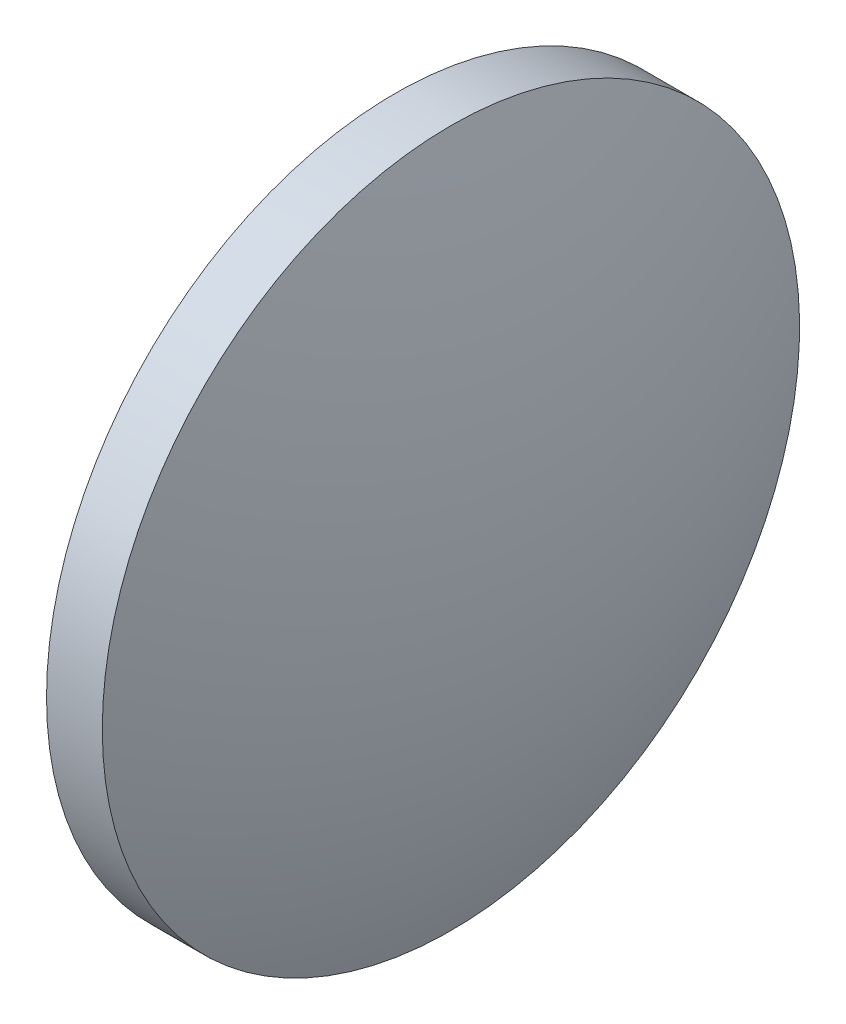
ISO-10303-21;
HEADER;
FILE_DESCRIPTION(('STEP AP214'),'2;1');
FILE_NAME('part.step','',(''),(''),'','','');
FILE_SCHEMA(('AUTOMOTIVE_DESIGN { 1 0 10303 214 1 1 1 1 }'));
ENDSEC;
DATA;
#1=APPLICATION_CONTEXT('core data for automotive mechanical design processes');
#2=APPLICATION_PROTOCOL_DEFINITION('international standard','automotive_design',2000,#1);
#3=PRODUCT_CONTEXT('',#1,'mechanical');
#4=PRODUCT('Part','Part','',(#3));
#5=PRODUCT_RELATED_PRODUCT_CATEGORY('part','',(#4));
#6=PRODUCT_DEFINITION_FORMATION('','',#4);
#7=PRODUCT_DEFINITION_CONTEXT('part definition',#1,'design');
#8=PRODUCT_DEFINITION('design','',#6,#7);
#9=PRODUCT_DEFINITION_SHAPE('','',#8);
#10=(LENGTH_UNIT() NAMED_UNIT(*) SI_UNIT(.MILLI.,.METRE.));
#11=(NAMED_UNIT(*) PLANE_ANGLE_UNIT() SI_UNIT($,.RADIAN.));
#12=(NAMED_UNIT(*) SI_UNIT($,.STERADIAN.) SOLID_ANGLE_UNIT());
#13=UNCERTAINTY_MEASURE_WITH_UNIT(LENGTH_MEASURE(1.E-05),#10,'distance_accuracy_value','');
#14=(GEOMETRIC_REPRESENTATION_CONTEXT(3) GLOBAL_UNCERTAINTY_ASSIGNED_CONTEXT((#13)) GLOBAL_UNIT_ASSIGNED_CONTEXT((#10,
#11,#12)) REPRESENTATION_CONTEXT('',''));
#15=CARTESIAN_POINT('',(0.,0.,0.));
#16=DIRECTION('',(0.,0.,1.));
#17=DIRECTION('',(1.,0.,0.));
#18=AXIS2_PLACEMENT_3D('',#15,#16,#17);
#19=CARTESIAN_POINT('',(346.780674841127,381.227799172368,0.));
#20=DIRECTION('',(-1.,0.,0.));
#21=DIRECTION('',(0.,1.,0.));
#22=AXIS2_PLACEMENT_3D('',#19,#20,#21);
#23=SPHERICAL_SURFACE('',#22,20.7892857142857);
#24=CARTESIAN_POINT('',(366.169960555413,381.227799172368,0.));
#25=DIRECTION('',(-1.,0.,0.));
#26=DIRECTION('',(0.,0.,1.));
#27=AXIS2_PLACEMENT_3D('',#24,#25,#26);
#28=CIRCLE('',#27,7.50000000000001);
#29=CARTESIAN_POINT('',(366.169960555413,381.227799172368,7.50000000000001));
#30=VERTEX_POINT('',#29);
#31=EDGE_CURVE('E10',#30,#30,#28,.T.);
#32=ORIENTED_EDGE('',*,*,#31,.F.);
#33=EDGE_LOOP('',(#32));
#34=FACE_BOUND('',#33,.T.);
#35=ADVANCED_FACE('F35',(#34),#23,.T.);
#36=CARTESIAN_POINT('',(362.12914842468,381.227799172368,0.));
#37=DIRECTION('',(-1.,0.,0.));
#38=DIRECTION('',(0.,0.,1.));
#39=AXIS2_PLACEMENT_3D('',#36,#37,#38);
#40=CYLINDRICAL_SURFACE('',#39,7.50000000000001);
#41=CARTESIAN_POINT('',(364.969960555413,381.227799172368,0.));
#42=DIRECTION('',(-1.,0.,0.));
#43=DIRECTION('',(0.,0.,1.));
#44=AXIS2_PLACEMENT_3D('',#41,#42,#43);
#45=CIRCLE('',#44,7.50000000000001);
#46=CARTESIAN_POINT('',(364.969960555413,381.227799172368,7.50000000000001));
#47=VERTEX_POINT('',#46);
#48=EDGE_CURVE('E41',#47,#47,#45,.T.);
#49=ORIENTED_EDGE('',*,*,#48,.F.);
#50=EDGE_LOOP('',(#49));
#51=FACE_BOUND('',#50,.T.);
#52=ORIENTED_EDGE('',*,*,#31,.T.);
#53=EDGE_LOOP('',(#52));
#54=FACE_BOUND('',#53,.T.);
#55=ADVANCED_FACE('F49',(#51,#54),#40,.T.);
#56=CARTESIAN_POINT('',(364.969960555413,381.227799172368,0.));
#57=DIRECTION('',(1.,0.,0.));
#58=DIRECTION('',(0.,0.,-1.));
#59=AXIS2_PLACEMENT_3D('',#56,#57,#58);
#60=PLANE('',#59);
#61=ORIENTED_EDGE('',*,*,#48,.T.);
#62=EDGE_LOOP('',(#61));
#63=FACE_BOUND('',#62,.T.);
#64=ADVANCED_FACE('F47',(#63),#60,.F.);
#65=CLOSED_SHELL('',(#35,#55,#64));
#66=MANIFOLD_SOLID_BREP('B2',#65);
#67=ADVANCED_BREP_SHAPE_REPRESENTATION('',(#18,#66),#14);
#68=SHAPE_DEFINITION_REPRESENTATION(#9,#67);
ENDSEC;
END-ISO-10303-21;
